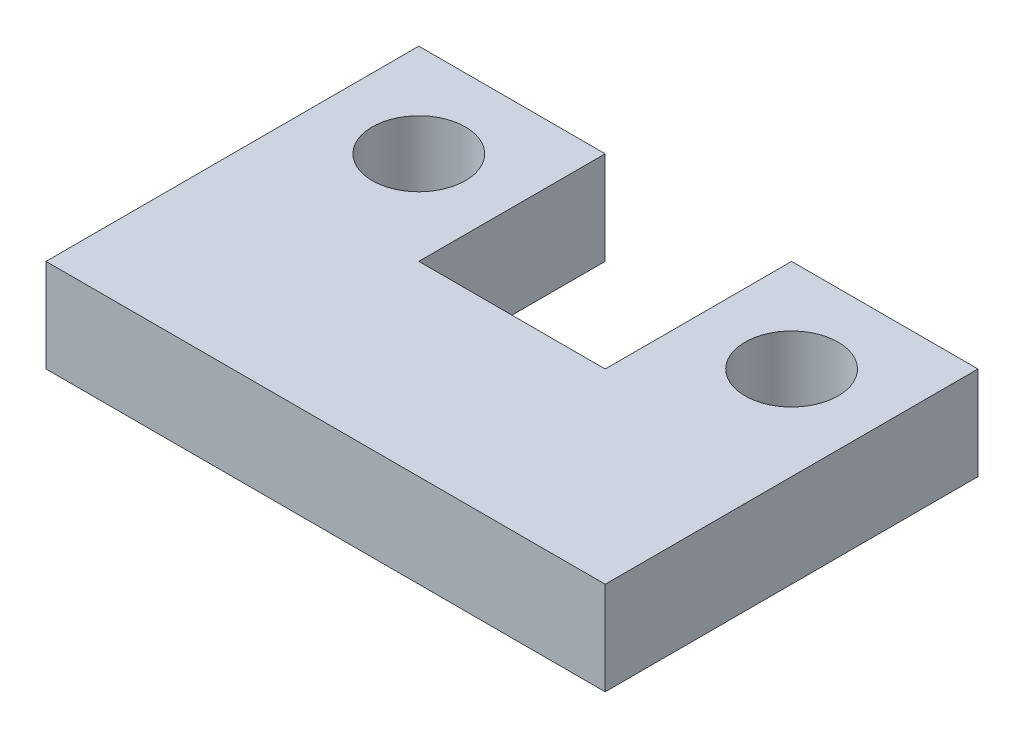
ISO-10303-21;
HEADER;
FILE_DESCRIPTION(('STEP AP214'),'2;1');
FILE_NAME('part.step','',(''),(''),'','','');
FILE_SCHEMA(('AUTOMOTIVE_DESIGN { 1 0 10303 214 1 1 1 1 }'));
ENDSEC;
DATA;
#1=APPLICATION_CONTEXT('core data for automotive mechanical design processes');
#2=APPLICATION_PROTOCOL_DEFINITION('international standard','automotive_design',2000,#1);
#3=PRODUCT_CONTEXT('',#1,'mechanical');
#4=PRODUCT('Part','Part','',(#3));
#5=PRODUCT_RELATED_PRODUCT_CATEGORY('part','',(#4));
#6=PRODUCT_DEFINITION_FORMATION('','',#4);
#7=PRODUCT_DEFINITION_CONTEXT('part definition',#1,'design');
#8=PRODUCT_DEFINITION('design','',#6,#7);
#9=PRODUCT_DEFINITION_SHAPE('','',#8);
#10=(LENGTH_UNIT() NAMED_UNIT(*) SI_UNIT(.MILLI.,.METRE.));
#11=(NAMED_UNIT(*) PLANE_ANGLE_UNIT() SI_UNIT($,.RADIAN.));
#12=(NAMED_UNIT(*) SI_UNIT($,.STERADIAN.) SOLID_ANGLE_UNIT());
#13=UNCERTAINTY_MEASURE_WITH_UNIT(LENGTH_MEASURE(1.E-05),#10,'distance_accuracy_value','');
#14=(GEOMETRIC_REPRESENTATION_CONTEXT(3) GLOBAL_UNCERTAINTY_ASSIGNED_CONTEXT((#13)) GLOBAL_UNIT_ASSIGNED_CONTEXT((#10,
#11,#12)) REPRESENTATION_CONTEXT('',''));
#15=CARTESIAN_POINT('',(0.,0.,0.));
#16=DIRECTION('',(0.,0.,1.));
#17=DIRECTION('',(1.,0.,0.));
#18=AXIS2_PLACEMENT_3D('',#15,#16,#17);
#19=CARTESIAN_POINT('',(0.,20.,-80.));
#20=DIRECTION('',(1.,0.,0.));
#21=DIRECTION('',(0.,0.,-1.));
#22=AXIS2_PLACEMENT_3D('',#19,#20,#21);
#23=PLANE('',#22);
#24=DIRECTION('',(0.,0.,1.));
#25=VECTOR('',#24,1.);
#26=CARTESIAN_POINT('',(0.,0.,-80.));
#27=LINE('',#26,#25);
#28=CARTESIAN_POINT('',(0.,0.,-80.));
#29=VERTEX_POINT('',#28);
#30=CARTESIAN_POINT('',(0.,0.,0.));
#31=VERTEX_POINT('',#30);
#32=EDGE_CURVE('E139',#29,#31,#27,.T.);
#33=ORIENTED_EDGE('',*,*,#32,.T.);
#34=DIRECTION('',(0.,-1.,0.));
#35=VECTOR('',#34,1.);
#36=CARTESIAN_POINT('',(0.,20.,0.));
#37=LINE('',#36,#35);
#38=CARTESIAN_POINT('',(0.,20.,0.));
#39=VERTEX_POINT('',#38);
#40=EDGE_CURVE('E11',#39,#31,#37,.T.);
#41=ORIENTED_EDGE('',*,*,#40,.F.);
#42=DIRECTION('',(0.,0.,1.));
#43=VECTOR('',#42,1.);
#44=CARTESIAN_POINT('',(0.,20.,-80.));
#45=LINE('',#44,#43);
#46=CARTESIAN_POINT('',(0.,20.,-80.));
#47=VERTEX_POINT('',#46);
#48=EDGE_CURVE('E162',#47,#39,#45,.T.);
#49=ORIENTED_EDGE('',*,*,#48,.F.);
#50=DIRECTION('',(0.,-1.,0.));
#51=VECTOR('',#50,1.);
#52=CARTESIAN_POINT('',(0.,20.,-80.));
#53=LINE('',#52,#51);
#54=EDGE_CURVE('E135',#47,#29,#53,.T.);
#55=ORIENTED_EDGE('',*,*,#54,.T.);
#56=EDGE_LOOP('',(#33,#41,#49,#55));
#57=FACE_BOUND('',#56,.T.);
#58=ADVANCED_FACE('F38',(#57),#23,.F.);
#59=CARTESIAN_POINT('',(0.,20.,0.));
#60=DIRECTION('',(0.,0.,-1.));
#61=DIRECTION('',(-1.,0.,0.));
#62=AXIS2_PLACEMENT_3D('',#59,#60,#61);
#63=PLANE('',#62);
#64=DIRECTION('',(1.,0.,0.));
#65=VECTOR('',#64,1.);
#66=CARTESIAN_POINT('',(0.,0.,0.));
#67=LINE('',#66,#65);
#68=CARTESIAN_POINT('',(120.,0.,0.));
#69=VERTEX_POINT('',#68);
#70=EDGE_CURVE('E143',#31,#69,#67,.T.);
#71=ORIENTED_EDGE('',*,*,#70,.T.);
#72=DIRECTION('',(0.,-1.,0.));
#73=VECTOR('',#72,1.);
#74=CARTESIAN_POINT('',(120.,20.,0.));
#75=LINE('',#74,#73);
#76=CARTESIAN_POINT('',(120.,20.,0.));
#77=VERTEX_POINT('',#76);
#78=EDGE_CURVE('E47',#77,#69,#75,.T.);
#79=ORIENTED_EDGE('',*,*,#78,.F.);
#80=DIRECTION('',(1.,0.,0.));
#81=VECTOR('',#80,1.);
#82=CARTESIAN_POINT('',(0.,20.,0.));
#83=LINE('',#82,#81);
#84=EDGE_CURVE('E98',#39,#77,#83,.T.);
#85=ORIENTED_EDGE('',*,*,#84,.F.);
#86=ORIENTED_EDGE('',*,*,#40,.T.);
#87=EDGE_LOOP('',(#71,#79,#85,#86));
#88=FACE_BOUND('',#87,.T.);
#89=ADVANCED_FACE('F245',(#88),#63,.F.);
#90=CARTESIAN_POINT('',(120.,20.,0.));
#91=DIRECTION('',(-1.,0.,0.));
#92=DIRECTION('',(0.,0.,1.));
#93=AXIS2_PLACEMENT_3D('',#90,#91,#92);
#94=PLANE('',#93);
#95=DIRECTION('',(0.,0.,-1.));
#96=VECTOR('',#95,1.);
#97=CARTESIAN_POINT('',(120.,0.,0.));
#98=LINE('',#97,#96);
#99=CARTESIAN_POINT('',(120.,0.,-80.));
#100=VERTEX_POINT('',#99);
#101=EDGE_CURVE('E147',#69,#100,#98,.T.);
#102=ORIENTED_EDGE('',*,*,#101,.T.);
#103=DIRECTION('',(0.,-1.,0.));
#104=VECTOR('',#103,1.);
#105=CARTESIAN_POINT('',(120.,20.,-80.));
#106=LINE('',#105,#104);
#107=CARTESIAN_POINT('',(120.,20.,-80.));
#108=VERTEX_POINT('',#107);
#109=EDGE_CURVE('E173',#108,#100,#106,.T.);
#110=ORIENTED_EDGE('',*,*,#109,.F.);
#111=DIRECTION('',(0.,0.,-1.));
#112=VECTOR('',#111,1.);
#113=CARTESIAN_POINT('',(120.,20.,0.));
#114=LINE('',#113,#112);
#115=EDGE_CURVE('E183',#77,#108,#114,.T.);
#116=ORIENTED_EDGE('',*,*,#115,.F.);
#117=ORIENTED_EDGE('',*,*,#78,.T.);
#118=EDGE_LOOP('',(#102,#110,#116,#117));
#119=FACE_BOUND('',#118,.T.);
#120=ADVANCED_FACE('F181',(#119),#94,.F.);
#121=CARTESIAN_POINT('',(120.,20.,-80.));
#122=DIRECTION('',(0.,0.,1.));
#123=DIRECTION('',(1.,0.,0.));
#124=AXIS2_PLACEMENT_3D('',#121,#122,#123);
#125=PLANE('',#124);
#126=DIRECTION('',(-1.,0.,0.));
#127=VECTOR('',#126,1.);
#128=CARTESIAN_POINT('',(120.,0.,-80.));
#129=LINE('',#128,#127);
#130=CARTESIAN_POINT('',(80.,0.,-80.));
#131=VERTEX_POINT('',#130);
#132=EDGE_CURVE('E150',#100,#131,#129,.T.);
#133=ORIENTED_EDGE('',*,*,#132,.T.);
#134=DIRECTION('',(0.,-1.,0.));
#135=VECTOR('',#134,1.);
#136=CARTESIAN_POINT('',(80.,20.,-80.));
#137=LINE('',#136,#135);
#138=CARTESIAN_POINT('',(80.,20.,-80.));
#139=VERTEX_POINT('',#138);
#140=EDGE_CURVE('E169',#139,#131,#137,.T.);
#141=ORIENTED_EDGE('',*,*,#140,.F.);
#142=DIRECTION('',(-1.,0.,0.));
#143=VECTOR('',#142,1.);
#144=CARTESIAN_POINT('',(120.,20.,-80.));
#145=LINE('',#144,#143);
#146=EDGE_CURVE('E196',#108,#139,#145,.T.);
#147=ORIENTED_EDGE('',*,*,#146,.F.);
#148=ORIENTED_EDGE('',*,*,#109,.T.);
#149=EDGE_LOOP('',(#133,#141,#147,#148));
#150=FACE_BOUND('',#149,.T.);
#151=ADVANCED_FACE('F191',(#150),#125,.F.);
#152=CARTESIAN_POINT('',(80.,20.,-80.));
#153=DIRECTION('',(1.,0.,0.));
#154=DIRECTION('',(0.,0.,-1.));
#155=AXIS2_PLACEMENT_3D('',#152,#153,#154);
#156=PLANE('',#155);
#157=DIRECTION('',(0.,0.,1.));
#158=VECTOR('',#157,1.);
#159=CARTESIAN_POINT('',(80.,0.,-80.));
#160=LINE('',#159,#158);
#161=CARTESIAN_POINT('',(80.,0.,-40.));
#162=VERTEX_POINT('',#161);
#163=EDGE_CURVE('E153',#131,#162,#160,.T.);
#164=ORIENTED_EDGE('',*,*,#163,.T.);
#165=DIRECTION('',(0.,-1.,0.));
#166=VECTOR('',#165,1.);
#167=CARTESIAN_POINT('',(80.,20.,-40.));
#168=LINE('',#167,#166);
#169=CARTESIAN_POINT('',(80.,20.,-40.));
#170=VERTEX_POINT('',#169);
#171=EDGE_CURVE('E128',#170,#162,#168,.T.);
#172=ORIENTED_EDGE('',*,*,#171,.F.);
#173=DIRECTION('',(0.,0.,1.));
#174=VECTOR('',#173,1.);
#175=CARTESIAN_POINT('',(80.,20.,-80.));
#176=LINE('',#175,#174);
#177=EDGE_CURVE('E117',#139,#170,#176,.T.);
#178=ORIENTED_EDGE('',*,*,#177,.F.);
#179=ORIENTED_EDGE('',*,*,#140,.T.);
#180=EDGE_LOOP('',(#164,#172,#178,#179));
#181=FACE_BOUND('',#180,.T.);
#182=ADVANCED_FACE('F194',(#181),#156,.F.);
#183=CARTESIAN_POINT('',(80.,20.,-40.));
#184=DIRECTION('',(0.,0.,1.));
#185=DIRECTION('',(1.,0.,0.));
#186=AXIS2_PLACEMENT_3D('',#183,#184,#185);
#187=PLANE('',#186);
#188=DIRECTION('',(-1.,0.,0.));
#189=VECTOR('',#188,1.);
#190=CARTESIAN_POINT('',(80.,0.,-40.));
#191=LINE('',#190,#189);
#192=CARTESIAN_POINT('',(40.,0.,-40.));
#193=VERTEX_POINT('',#192);
#194=EDGE_CURVE('E126',#162,#193,#191,.T.);
#195=ORIENTED_EDGE('',*,*,#194,.T.);
#196=DIRECTION('',(0.,-1.,0.));
#197=VECTOR('',#196,1.);
#198=CARTESIAN_POINT('',(40.,20.,-40.));
#199=LINE('',#198,#197);
#200=CARTESIAN_POINT('',(40.,20.,-40.));
#201=VERTEX_POINT('',#200);
#202=EDGE_CURVE('E123',#201,#193,#199,.T.);
#203=ORIENTED_EDGE('',*,*,#202,.F.);
#204=DIRECTION('',(-1.,0.,0.));
#205=VECTOR('',#204,1.);
#206=CARTESIAN_POINT('',(80.,20.,-40.));
#207=LINE('',#206,#205);
#208=EDGE_CURVE('E111',#170,#201,#207,.T.);
#209=ORIENTED_EDGE('',*,*,#208,.F.);
#210=ORIENTED_EDGE('',*,*,#171,.T.);
#211=EDGE_LOOP('',(#195,#203,#209,#210));
#212=FACE_BOUND('',#211,.T.);
#213=ADVANCED_FACE('F124',(#212),#187,.F.);
#214=CARTESIAN_POINT('',(40.,20.,-40.));
#215=DIRECTION('',(-1.,0.,0.));
#216=DIRECTION('',(0.,0.,1.));
#217=AXIS2_PLACEMENT_3D('',#214,#215,#216);
#218=PLANE('',#217);
#219=DIRECTION('',(0.,0.,-1.));
#220=VECTOR('',#219,1.);
#221=CARTESIAN_POINT('',(40.,0.,-40.));
#222=LINE('',#221,#220);
#223=CARTESIAN_POINT('',(40.,0.,-80.));
#224=VERTEX_POINT('',#223);
#225=EDGE_CURVE('E84',#193,#224,#222,.T.);
#226=ORIENTED_EDGE('',*,*,#225,.T.);
#227=DIRECTION('',(0.,-1.,0.));
#228=VECTOR('',#227,1.);
#229=CARTESIAN_POINT('',(40.,20.,-80.));
#230=LINE('',#229,#228);
#231=CARTESIAN_POINT('',(40.,20.,-80.));
#232=VERTEX_POINT('',#231);
#233=EDGE_CURVE('E129',#232,#224,#230,.T.);
#234=ORIENTED_EDGE('',*,*,#233,.F.);
#235=DIRECTION('',(0.,0.,-1.));
#236=VECTOR('',#235,1.);
#237=CARTESIAN_POINT('',(40.,20.,-40.));
#238=LINE('',#237,#236);
#239=EDGE_CURVE('E115',#201,#232,#238,.T.);
#240=ORIENTED_EDGE('',*,*,#239,.F.);
#241=ORIENTED_EDGE('',*,*,#202,.T.);
#242=EDGE_LOOP('',(#226,#234,#240,#241));
#243=FACE_BOUND('',#242,.T.);
#244=ADVANCED_FACE('F131',(#243),#218,.F.);
#245=CARTESIAN_POINT('',(40.,20.,-80.));
#246=DIRECTION('',(0.,0.,1.));
#247=DIRECTION('',(1.,0.,0.));
#248=AXIS2_PLACEMENT_3D('',#245,#246,#247);
#249=PLANE('',#248);
#250=DIRECTION('',(-1.,0.,0.));
#251=VECTOR('',#250,1.);
#252=CARTESIAN_POINT('',(40.,0.,-80.));
#253=LINE('',#252,#251);
#254=EDGE_CURVE('E90',#224,#29,#253,.T.);
#255=ORIENTED_EDGE('',*,*,#254,.T.);
#256=ORIENTED_EDGE('',*,*,#54,.F.);
#257=DIRECTION('',(-1.,0.,0.));
#258=VECTOR('',#257,1.);
#259=CARTESIAN_POINT('',(40.,20.,-80.));
#260=LINE('',#259,#258);
#261=EDGE_CURVE('E55',#232,#47,#260,.T.);
#262=ORIENTED_EDGE('',*,*,#261,.F.);
#263=ORIENTED_EDGE('',*,*,#233,.T.);
#264=EDGE_LOOP('',(#255,#256,#262,#263));
#265=FACE_BOUND('',#264,.T.);
#266=ADVANCED_FACE('F252',(#265),#249,.F.);
#267=CARTESIAN_POINT('',(0.,20.,0.));
#268=DIRECTION('',(0.,1.,0.));
#269=DIRECTION('',(0.,0.,1.));
#270=AXIS2_PLACEMENT_3D('',#267,#268,#269);
#271=PLANE('',#270);
#272=CARTESIAN_POINT('',(20.,20.,-60.));
#273=DIRECTION('',(0.,-1.,0.));
#274=DIRECTION('',(0.,0.,-1.));
#275=AXIS2_PLACEMENT_3D('',#272,#273,#274);
#276=CIRCLE('',#275,10.);
#277=CARTESIAN_POINT('',(20.,20.,-70.));
#278=VERTEX_POINT('',#277);
#279=EDGE_CURVE('E144',#278,#278,#276,.T.);
#280=ORIENTED_EDGE('',*,*,#279,.T.);
#281=EDGE_LOOP('',(#280));
#282=FACE_BOUND('',#281,.T.);
#283=CARTESIAN_POINT('',(100.,20.,-60.));
#284=DIRECTION('',(0.,-1.,0.));
#285=DIRECTION('',(0.,0.,-1.));
#286=AXIS2_PLACEMENT_3D('',#283,#284,#285);
#287=CIRCLE('',#286,9.99999999999999);
#288=CARTESIAN_POINT('',(100.,20.,-70.));
#289=VERTEX_POINT('',#288);
#290=EDGE_CURVE('E210',#289,#289,#287,.T.);
#291=ORIENTED_EDGE('',*,*,#290,.T.);
#292=EDGE_LOOP('',(#291));
#293=FACE_BOUND('',#292,.T.);
#294=ORIENTED_EDGE('',*,*,#48,.T.);
#295=ORIENTED_EDGE('',*,*,#84,.T.);
#296=ORIENTED_EDGE('',*,*,#115,.T.);
#297=ORIENTED_EDGE('',*,*,#146,.T.);
#298=ORIENTED_EDGE('',*,*,#177,.T.);
#299=ORIENTED_EDGE('',*,*,#208,.T.);
#300=ORIENTED_EDGE('',*,*,#239,.T.);
#301=ORIENTED_EDGE('',*,*,#261,.T.);
#302=EDGE_LOOP('',(#294,#295,#296,#297,#298,#299,#300,#301));
#303=FACE_BOUND('',#302,.T.);
#304=ADVANCED_FACE('F113',(#282,#293,#303),#271,.T.);
#305=CARTESIAN_POINT('',(0.,0.,0.));
#306=DIRECTION('',(0.,1.,0.));
#307=DIRECTION('',(0.,0.,1.));
#308=AXIS2_PLACEMENT_3D('',#305,#306,#307);
#309=PLANE('',#308);
#310=CARTESIAN_POINT('',(20.,0.,-60.));
#311=DIRECTION('',(0.,-1.,0.));
#312=DIRECTION('',(0.,0.,-1.));
#313=AXIS2_PLACEMENT_3D('',#310,#311,#312);
#314=CIRCLE('',#313,10.);
#315=CARTESIAN_POINT('',(20.,0.,-70.));
#316=VERTEX_POINT('',#315);
#317=EDGE_CURVE('E214',#316,#316,#314,.T.);
#318=ORIENTED_EDGE('',*,*,#317,.F.);
#319=EDGE_LOOP('',(#318));
#320=FACE_BOUND('',#319,.T.);
#321=CARTESIAN_POINT('',(100.,0.,-60.));
#322=DIRECTION('',(0.,-1.,0.));
#323=DIRECTION('',(0.,0.,-1.));
#324=AXIS2_PLACEMENT_3D('',#321,#322,#323);
#325=CIRCLE('',#324,9.99999999999999);
#326=CARTESIAN_POINT('',(100.,0.,-70.));
#327=VERTEX_POINT('',#326);
#328=EDGE_CURVE('E206',#327,#327,#325,.T.);
#329=ORIENTED_EDGE('',*,*,#328,.F.);
#330=EDGE_LOOP('',(#329));
#331=FACE_BOUND('',#330,.T.);
#332=ORIENTED_EDGE('',*,*,#32,.F.);
#333=ORIENTED_EDGE('',*,*,#254,.F.);
#334=ORIENTED_EDGE('',*,*,#225,.F.);
#335=ORIENTED_EDGE('',*,*,#194,.F.);
#336=ORIENTED_EDGE('',*,*,#163,.F.);
#337=ORIENTED_EDGE('',*,*,#132,.F.);
#338=ORIENTED_EDGE('',*,*,#101,.F.);
#339=ORIENTED_EDGE('',*,*,#70,.F.);
#340=EDGE_LOOP('',(#332,#333,#334,#335,#336,#337,#338,#339));
#341=FACE_BOUND('',#340,.T.);
#342=ADVANCED_FACE('F187',(#320,#331,#341),#309,.F.);
#343=CARTESIAN_POINT('',(100.,20.,-60.));
#344=DIRECTION('',(0.,-1.,0.));
#345=DIRECTION('',(0.,0.,-1.));
#346=AXIS2_PLACEMENT_3D('',#343,#344,#345);
#347=CYLINDRICAL_SURFACE('',#346,9.99999999999999);
#348=ORIENTED_EDGE('',*,*,#290,.F.);
#349=EDGE_LOOP('',(#348));
#350=FACE_BOUND('',#349,.T.);
#351=ORIENTED_EDGE('',*,*,#328,.T.);
#352=EDGE_LOOP('',(#351));
#353=FACE_BOUND('',#352,.T.);
#354=ADVANCED_FACE('F227',(#350,#353),#347,.F.);
#355=CARTESIAN_POINT('',(20.,20.,-60.));
#356=DIRECTION('',(0.,-1.,0.));
#357=DIRECTION('',(0.,0.,-1.));
#358=AXIS2_PLACEMENT_3D('',#355,#356,#357);
#359=CYLINDRICAL_SURFACE('',#358,10.);
#360=ORIENTED_EDGE('',*,*,#279,.F.);
#361=EDGE_LOOP('',(#360));
#362=FACE_BOUND('',#361,.T.);
#363=ORIENTED_EDGE('',*,*,#317,.T.);
#364=EDGE_LOOP('',(#363));
#365=FACE_BOUND('',#364,.T.);
#366=ADVANCED_FACE('F224',(#362,#365),#359,.F.);
#367=CLOSED_SHELL('',(#58,#89,#120,#151,#182,#213,#244,#266,#304,#342,#354,#366));
#368=MANIFOLD_SOLID_BREP('B2',#367);
#369=ADVANCED_BREP_SHAPE_REPRESENTATION('',(#18,#368),#14);
#370=SHAPE_DEFINITION_REPRESENTATION(#9,#369);
ENDSEC;
END-ISO-10303-21;
